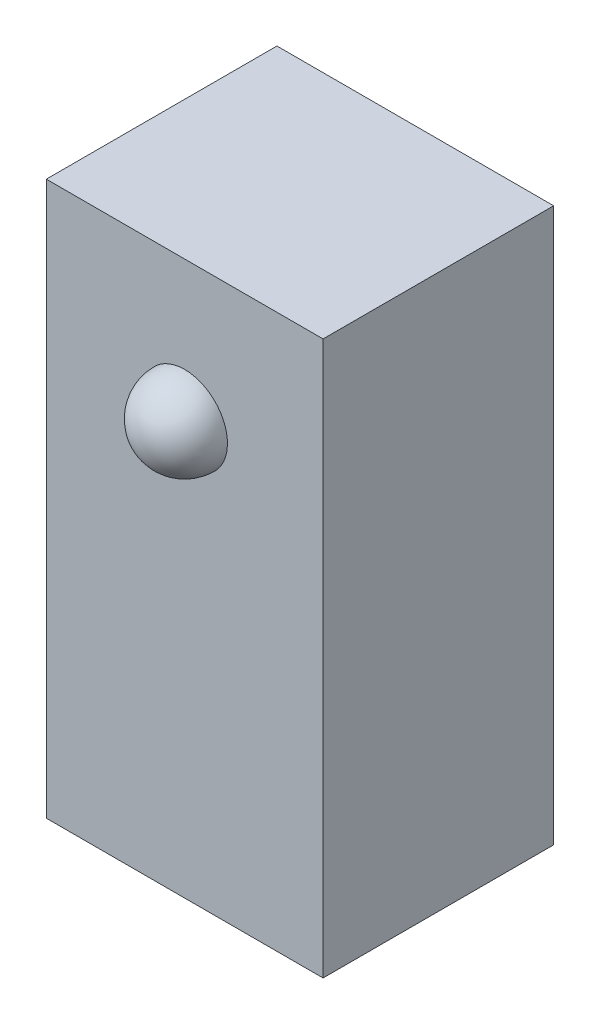
ISO-10303-21;
HEADER;
FILE_DESCRIPTION(('STEP AP214'),'2;1');
FILE_NAME('part.step','',(''),(''),'','','');
FILE_SCHEMA(('AUTOMOTIVE_DESIGN { 1 0 10303 214 1 1 1 1 }'));
ENDSEC;
DATA;
#1=APPLICATION_CONTEXT('core data for automotive mechanical design processes');
#2=APPLICATION_PROTOCOL_DEFINITION('international standard','automotive_design',2000,#1);
#3=PRODUCT_CONTEXT('',#1,'mechanical');
#4=PRODUCT('Part','Part','',(#3));
#5=PRODUCT_RELATED_PRODUCT_CATEGORY('part','',(#4));
#6=PRODUCT_DEFINITION_FORMATION('','',#4);
#7=PRODUCT_DEFINITION_CONTEXT('part definition',#1,'design');
#8=PRODUCT_DEFINITION('design','',#6,#7);
#9=PRODUCT_DEFINITION_SHAPE('','',#8);
#10=(LENGTH_UNIT() NAMED_UNIT(*) SI_UNIT(.MILLI.,.METRE.));
#11=(NAMED_UNIT(*) PLANE_ANGLE_UNIT() SI_UNIT($,.RADIAN.));
#12=(NAMED_UNIT(*) SI_UNIT($,.STERADIAN.) SOLID_ANGLE_UNIT());
#13=UNCERTAINTY_MEASURE_WITH_UNIT(LENGTH_MEASURE(1.E-05),#10,'distance_accuracy_value','');
#14=(GEOMETRIC_REPRESENTATION_CONTEXT(3) GLOBAL_UNCERTAINTY_ASSIGNED_CONTEXT((#13)) GLOBAL_UNIT_ASSIGNED_CONTEXT((#10,
#11,#12)) REPRESENTATION_CONTEXT('',''));
#15=CARTESIAN_POINT('',(0.,0.,0.));
#16=DIRECTION('',(0.,0.,1.));
#17=DIRECTION('',(1.,0.,0.));
#18=AXIS2_PLACEMENT_3D('',#15,#16,#17);
#19=CARTESIAN_POINT('',(4.7625,19.05,3.96875));
#20=DIRECTION('',(-1.,0.,0.));
#21=DIRECTION('',(0.,0.,1.));
#22=AXIS2_PLACEMENT_3D('',#19,#20,#21);
#23=PLANE('',#22);
#24=DIRECTION('',(0.,0.,-1.));
#25=VECTOR('',#24,1.);
#26=CARTESIAN_POINT('',(4.7625,0.,3.96875));
#27=LINE('',#26,#25);
#28=CARTESIAN_POINT('',(4.7625,0.,3.96875));
#29=VERTEX_POINT('',#28);
#30=CARTESIAN_POINT('',(4.7625,0.,-3.96875));
#31=VERTEX_POINT('',#30);
#32=EDGE_CURVE('E99',#29,#31,#27,.T.);
#33=ORIENTED_EDGE('',*,*,#32,.T.);
#34=DIRECTION('',(0.,-1.,0.));
#35=VECTOR('',#34,1.);
#36=CARTESIAN_POINT('',(4.7625,19.05,-3.96875));
#37=LINE('',#36,#35);
#38=CARTESIAN_POINT('',(4.7625,19.05,-3.96875));
#39=VERTEX_POINT('',#38);
#40=EDGE_CURVE('E11',#39,#31,#37,.T.);
#41=ORIENTED_EDGE('',*,*,#40,.F.);
#42=DIRECTION('',(0.,0.,-1.));
#43=VECTOR('',#42,1.);
#44=CARTESIAN_POINT('',(4.7625,19.05,3.96875));
#45=LINE('',#44,#43);
#46=CARTESIAN_POINT('',(4.7625,19.05,3.96875));
#47=VERTEX_POINT('',#46);
#48=EDGE_CURVE('E87',#47,#39,#45,.T.);
#49=ORIENTED_EDGE('',*,*,#48,.F.);
#50=DIRECTION('',(0.,-1.,0.));
#51=VECTOR('',#50,1.);
#52=CARTESIAN_POINT('',(4.7625,19.05,3.96875));
#53=LINE('',#52,#51);
#54=EDGE_CURVE('E95',#47,#29,#53,.T.);
#55=ORIENTED_EDGE('',*,*,#54,.T.);
#56=EDGE_LOOP('',(#33,#41,#49,#55));
#57=FACE_BOUND('',#56,.T.);
#58=ADVANCED_FACE('F36',(#57),#23,.F.);
#59=CARTESIAN_POINT('',(-4.7625,19.05,-3.96875));
#60=DIRECTION('',(0.,0.,1.));
#61=DIRECTION('',(1.,0.,0.));
#62=AXIS2_PLACEMENT_3D('',#59,#60,#61);
#63=PLANE('',#62);
#64=DIRECTION('',(-1.,0.,0.));
#65=VECTOR('',#64,1.);
#66=CARTESIAN_POINT('',(-4.7625,0.,-3.96875));
#67=LINE('',#66,#65);
#68=CARTESIAN_POINT('',(-4.7625,0.,-3.96875));
#69=VERTEX_POINT('',#68);
#70=EDGE_CURVE('E91',#31,#69,#67,.T.);
#71=ORIENTED_EDGE('',*,*,#70,.T.);
#72=DIRECTION('',(0.,-1.,0.));
#73=VECTOR('',#72,1.);
#74=CARTESIAN_POINT('',(-4.7625,19.05,-3.96875));
#75=LINE('',#74,#73);
#76=CARTESIAN_POINT('',(-4.7625,19.05,-3.96875));
#77=VERTEX_POINT('',#76);
#78=EDGE_CURVE('E44',#77,#69,#75,.T.);
#79=ORIENTED_EDGE('',*,*,#78,.F.);
#80=DIRECTION('',(-1.,0.,0.));
#81=VECTOR('',#80,1.);
#82=CARTESIAN_POINT('',(-4.7625,19.05,-3.96875));
#83=LINE('',#82,#81);
#84=EDGE_CURVE('E82',#39,#77,#83,.T.);
#85=ORIENTED_EDGE('',*,*,#84,.F.);
#86=ORIENTED_EDGE('',*,*,#40,.T.);
#87=EDGE_LOOP('',(#71,#79,#85,#86));
#88=FACE_BOUND('',#87,.T.);
#89=ADVANCED_FACE('F90',(#88),#63,.F.);
#90=CARTESIAN_POINT('',(-4.7625,19.05,3.96875));
#91=DIRECTION('',(1.,0.,0.));
#92=DIRECTION('',(0.,0.,-1.));
#93=AXIS2_PLACEMENT_3D('',#90,#91,#92);
#94=PLANE('',#93);
#95=DIRECTION('',(0.,0.,1.));
#96=VECTOR('',#95,1.);
#97=CARTESIAN_POINT('',(-4.7625,0.,3.96875));
#98=LINE('',#97,#96);
#99=CARTESIAN_POINT('',(-4.7625,0.,3.96875));
#100=VERTEX_POINT('',#99);
#101=EDGE_CURVE('E69',#69,#100,#98,.T.);
#102=ORIENTED_EDGE('',*,*,#101,.T.);
#103=DIRECTION('',(0.,-1.,0.));
#104=VECTOR('',#103,1.);
#105=CARTESIAN_POINT('',(-4.7625,19.05,3.96875));
#106=LINE('',#105,#104);
#107=CARTESIAN_POINT('',(-4.7625,19.05,3.96875));
#108=VERTEX_POINT('',#107);
#109=EDGE_CURVE('E92',#108,#100,#106,.T.);
#110=ORIENTED_EDGE('',*,*,#109,.F.);
#111=DIRECTION('',(0.,0.,1.));
#112=VECTOR('',#111,1.);
#113=CARTESIAN_POINT('',(-4.7625,19.05,3.96875));
#114=LINE('',#113,#112);
#115=EDGE_CURVE('E85',#77,#108,#114,.T.);
#116=ORIENTED_EDGE('',*,*,#115,.F.);
#117=ORIENTED_EDGE('',*,*,#78,.T.);
#118=EDGE_LOOP('',(#102,#110,#116,#117));
#119=FACE_BOUND('',#118,.T.);
#120=ADVANCED_FACE('F93',(#119),#94,.F.);
#121=CARTESIAN_POINT('',(-4.7625,19.05,3.96875));
#122=DIRECTION('',(0.,0.,-1.));
#123=DIRECTION('',(-1.,0.,0.));
#124=AXIS2_PLACEMENT_3D('',#121,#122,#123);
#125=PLANE('',#124);
#126=CARTESIAN_POINT('',(0.,14.2875,3.96875));
#127=DIRECTION('',(0.,0.,-1.));
#128=DIRECTION('',(-1.,0.,0.));
#129=AXIS2_PLACEMENT_3D('',#126,#127,#128);
#130=CIRCLE('',#129,1.47147477134085);
#131=CARTESIAN_POINT('',(-1.47147477134085,14.2875,3.96875));
#132=VERTEX_POINT('',#131);
#133=EDGE_CURVE('E102',#132,#132,#130,.T.);
#134=ORIENTED_EDGE('',*,*,#133,.T.);
#135=EDGE_LOOP('',(#134));
#136=FACE_BOUND('',#135,.T.);
#137=DIRECTION('',(1.,0.,0.));
#138=VECTOR('',#137,1.);
#139=CARTESIAN_POINT('',(-4.7625,0.,3.96875));
#140=LINE('',#139,#138);
#141=EDGE_CURVE('E75',#100,#29,#140,.T.);
#142=ORIENTED_EDGE('',*,*,#141,.T.);
#143=ORIENTED_EDGE('',*,*,#54,.F.);
#144=DIRECTION('',(1.,0.,0.));
#145=VECTOR('',#144,1.);
#146=CARTESIAN_POINT('',(-4.7625,19.05,3.96875));
#147=LINE('',#146,#145);
#148=EDGE_CURVE('E52',#108,#47,#147,.T.);
#149=ORIENTED_EDGE('',*,*,#148,.F.);
#150=ORIENTED_EDGE('',*,*,#109,.T.);
#151=EDGE_LOOP('',(#142,#143,#149,#150));
#152=FACE_BOUND('',#151,.T.);
#153=ADVANCED_FACE('F107',(#136,#152),#125,.F.);
#154=CARTESIAN_POINT('',(0.,19.05,0.));
#155=DIRECTION('',(0.,-1.,0.));
#156=DIRECTION('',(0.,0.,-1.));
#157=AXIS2_PLACEMENT_3D('',#154,#155,#156);
#158=PLANE('',#157);
#159=ORIENTED_EDGE('',*,*,#48,.T.);
#160=ORIENTED_EDGE('',*,*,#84,.T.);
#161=ORIENTED_EDGE('',*,*,#115,.T.);
#162=ORIENTED_EDGE('',*,*,#148,.T.);
#163=EDGE_LOOP('',(#159,#160,#161,#162));
#164=FACE_BOUND('',#163,.T.);
#165=ADVANCED_FACE('F83',(#164),#158,.F.);
#166=CARTESIAN_POINT('',(0.,0.,0.));
#167=DIRECTION('',(0.,-1.,0.));
#168=DIRECTION('',(0.,0.,-1.));
#169=AXIS2_PLACEMENT_3D('',#166,#167,#168);
#170=PLANE('',#169);
#171=ORIENTED_EDGE('',*,*,#32,.F.);
#172=ORIENTED_EDGE('',*,*,#141,.F.);
#173=ORIENTED_EDGE('',*,*,#101,.F.);
#174=ORIENTED_EDGE('',*,*,#70,.F.);
#175=EDGE_LOOP('',(#171,#172,#173,#174));
#176=FACE_BOUND('',#175,.T.);
#177=ADVANCED_FACE('F110',(#176),#170,.T.);
#178=CARTESIAN_POINT('',(0.,14.2875,3.96875));
#179=DIRECTION('',(0.,0.,-1.));
#180=DIRECTION('',(0.,1.,0.));
#181=AXIS2_PLACEMENT_3D('',#178,#179,#180);
#182=SPHERICAL_SURFACE('',#181,1.47147477134085);
#183=ORIENTED_EDGE('',*,*,#133,.F.);
#184=EDGE_LOOP('',(#183));
#185=FACE_BOUND('',#184,.T.);
#186=ADVANCED_FACE('F117',(#185),#182,.T.);
#187=CLOSED_SHELL('',(#58,#89,#120,#153,#165,#177,#186));
#188=MANIFOLD_SOLID_BREP('B2',#187);
#189=ADVANCED_BREP_SHAPE_REPRESENTATION('',(#18,#188),#14);
#190=SHAPE_DEFINITION_REPRESENTATION(#9,#189);
ENDSEC;
END-ISO-10303-21;
